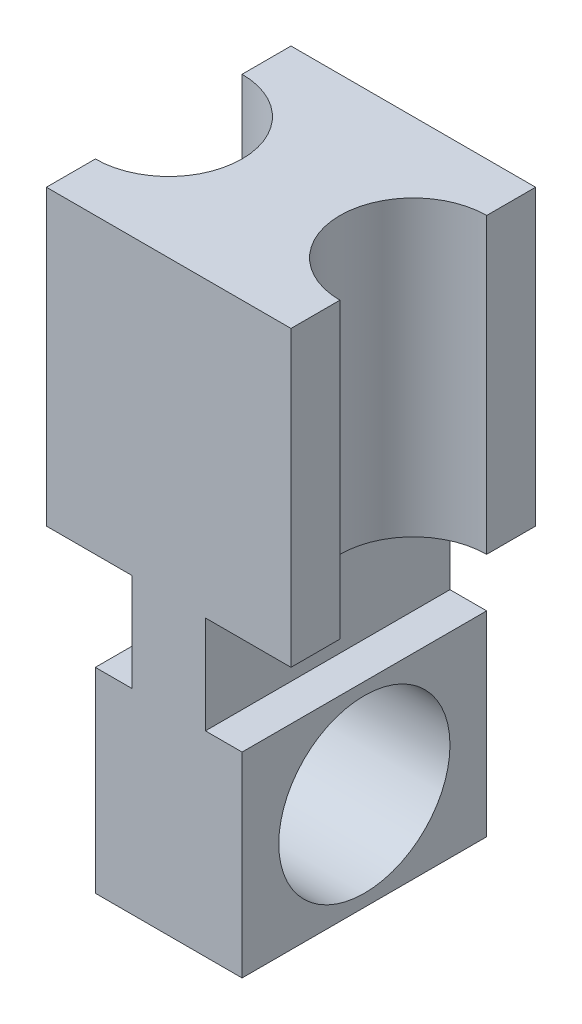
ISO-10303-21;
HEADER;
FILE_DESCRIPTION(('STEP AP214'),'2;1');
FILE_NAME('part.step','',(''),(''),'','','');
FILE_SCHEMA(('AUTOMOTIVE_DESIGN { 1 0 10303 214 1 1 1 1 }'));
ENDSEC;
DATA;
#1=APPLICATION_CONTEXT('core data for automotive mechanical design processes');
#2=APPLICATION_PROTOCOL_DEFINITION('international standard','automotive_design',2000,#1);
#3=PRODUCT_CONTEXT('',#1,'mechanical');
#4=PRODUCT('Part','Part','',(#3));
#5=PRODUCT_RELATED_PRODUCT_CATEGORY('part','',(#4));
#6=PRODUCT_DEFINITION_FORMATION('','',#4);
#7=PRODUCT_DEFINITION_CONTEXT('part definition',#1,'design');
#8=PRODUCT_DEFINITION('design','',#6,#7);
#9=PRODUCT_DEFINITION_SHAPE('','',#8);
#10=(LENGTH_UNIT() NAMED_UNIT(*) SI_UNIT(.MILLI.,.METRE.));
#11=(NAMED_UNIT(*) PLANE_ANGLE_UNIT() SI_UNIT($,.RADIAN.));
#12=(NAMED_UNIT(*) SI_UNIT($,.STERADIAN.) SOLID_ANGLE_UNIT());
#13=UNCERTAINTY_MEASURE_WITH_UNIT(LENGTH_MEASURE(1.E-05),#10,'distance_accuracy_value','');
#14=(GEOMETRIC_REPRESENTATION_CONTEXT(3) GLOBAL_UNCERTAINTY_ASSIGNED_CONTEXT((#13)) GLOBAL_UNIT_ASSIGNED_CONTEXT((#10,
#11,#12)) REPRESENTATION_CONTEXT('',''));
#15=CARTESIAN_POINT('',(0.,0.,0.));
#16=DIRECTION('',(0.,0.,1.));
#17=DIRECTION('',(1.,0.,0.));
#18=AXIS2_PLACEMENT_3D('',#15,#16,#17);
#19=CARTESIAN_POINT('',(0.,152.4,-127.));
#20=DIRECTION('',(0.,0.,-1.));
#21=DIRECTION('',(-1.,0.,0.));
#22=AXIS2_PLACEMENT_3D('',#19,#20,#21);
#23=PLANE('',#22);
#24=DIRECTION('',(1.,0.,0.));
#25=VECTOR('',#24,1.);
#26=CARTESIAN_POINT('',(1.58603289232165E-13,-50.8,-127.));
#27=LINE('',#26,#25);
#28=CARTESIAN_POINT('',(82.55,-50.8,-127.));
#29=VERTEX_POINT('',#28);
#30=CARTESIAN_POINT('',(101.6,-50.8,-127.));
#31=VERTEX_POINT('',#30);
#32=EDGE_CURVE('E299',#29,#31,#27,.T.);
#33=ORIENTED_EDGE('',*,*,#32,.T.);
#34=DIRECTION('',(0.,-1.,0.));
#35=VECTOR('',#34,1.);
#36=CARTESIAN_POINT('',(101.6,152.4,-127.));
#37=LINE('',#36,#35);
#38=CARTESIAN_POINT('',(101.6,-152.4,-127.));
#39=VERTEX_POINT('',#38);
#40=EDGE_CURVE('E219',#31,#39,#37,.T.);
#41=ORIENTED_EDGE('',*,*,#40,.T.);
#42=DIRECTION('',(-1.,0.,0.));
#43=VECTOR('',#42,1.);
#44=CARTESIAN_POINT('',(0.,-152.4,-127.));
#45=LINE('',#44,#43);
#46=CARTESIAN_POINT('',(25.4,-152.4,-127.));
#47=VERTEX_POINT('',#46);
#48=EDGE_CURVE('E294',#39,#47,#45,.T.);
#49=ORIENTED_EDGE('',*,*,#48,.T.);
#50=DIRECTION('',(0.,-1.,0.));
#51=VECTOR('',#50,1.);
#52=CARTESIAN_POINT('',(25.4,152.4,-127.));
#53=LINE('',#52,#51);
#54=CARTESIAN_POINT('',(25.4,-50.8,-127.));
#55=VERTEX_POINT('',#54);
#56=EDGE_CURVE('E232',#55,#47,#53,.T.);
#57=ORIENTED_EDGE('',*,*,#56,.F.);
#58=DIRECTION('',(1.,0.,0.));
#59=VECTOR('',#58,1.);
#60=CARTESIAN_POINT('',(0.,-50.8,-127.));
#61=LINE('',#60,#59);
#62=CARTESIAN_POINT('',(44.45,-50.8,-127.));
#63=VERTEX_POINT('',#62);
#64=EDGE_CURVE('E298',#55,#63,#61,.T.);
#65=ORIENTED_EDGE('',*,*,#64,.T.);
#66=DIRECTION('',(0.,1.,0.));
#67=VECTOR('',#66,1.);
#68=CARTESIAN_POINT('',(44.4500000000001,152.4,-127.));
#69=LINE('',#68,#67);
#70=CARTESIAN_POINT('',(44.45,0.,-127.));
#71=VERTEX_POINT('',#70);
#72=EDGE_CURVE('E311',#63,#71,#69,.T.);
#73=ORIENTED_EDGE('',*,*,#72,.T.);
#74=DIRECTION('',(-1.,0.,0.));
#75=VECTOR('',#74,1.);
#76=CARTESIAN_POINT('',(0.,0.,-127.));
#77=LINE('',#76,#75);
#78=CARTESIAN_POINT('',(0.,0.,-127.));
#79=VERTEX_POINT('',#78);
#80=EDGE_CURVE('E284',#71,#79,#77,.T.);
#81=ORIENTED_EDGE('',*,*,#80,.T.);
#82=DIRECTION('',(0.,-1.,0.));
#83=VECTOR('',#82,1.);
#84=CARTESIAN_POINT('',(0.,152.4,-127.));
#85=LINE('',#84,#83);
#86=CARTESIAN_POINT('',(0.,152.4,-127.));
#87=VERTEX_POINT('',#86);
#88=EDGE_CURVE('E214',#87,#79,#85,.T.);
#89=ORIENTED_EDGE('',*,*,#88,.F.);
#90=DIRECTION('',(1.,0.,0.));
#91=VECTOR('',#90,1.);
#92=CARTESIAN_POINT('',(0.,152.4,-127.));
#93=LINE('',#92,#91);
#94=CARTESIAN_POINT('',(127.,152.4,-127.));
#95=VERTEX_POINT('',#94);
#96=EDGE_CURVE('E223',#87,#95,#93,.T.);
#97=ORIENTED_EDGE('',*,*,#96,.T.);
#98=DIRECTION('',(0.,-1.,0.));
#99=VECTOR('',#98,1.);
#100=CARTESIAN_POINT('',(127.,152.4,-127.));
#101=LINE('',#100,#99);
#102=CARTESIAN_POINT('',(127.,0.,-127.));
#103=VERTEX_POINT('',#102);
#104=EDGE_CURVE('E209',#95,#103,#101,.T.);
#105=ORIENTED_EDGE('',*,*,#104,.T.);
#106=DIRECTION('',(-1.,0.,0.));
#107=VECTOR('',#106,1.);
#108=CARTESIAN_POINT('',(0.,0.,-127.));
#109=LINE('',#108,#107);
#110=CARTESIAN_POINT('',(82.55,0.,-127.));
#111=VERTEX_POINT('',#110);
#112=EDGE_CURVE('E213',#103,#111,#109,.T.);
#113=ORIENTED_EDGE('',*,*,#112,.T.);
#114=DIRECTION('',(0.,-1.,0.));
#115=VECTOR('',#114,1.);
#116=CARTESIAN_POINT('',(82.55,152.4,-127.));
#117=LINE('',#116,#115);
#118=EDGE_CURVE('E303',#111,#29,#117,.T.);
#119=ORIENTED_EDGE('',*,*,#118,.T.);
#120=EDGE_LOOP('',(#33,#41,#49,#57,#65,#73,#81,#89,#97,#105,#113,#119));
#121=FACE_BOUND('',#120,.T.);
#122=ADVANCED_FACE('F38',(#121),#23,.T.);
#123=CARTESIAN_POINT('',(0.,152.4,0.));
#124=DIRECTION('',(0.,0.,-1.));
#125=DIRECTION('',(-1.,0.,0.));
#126=AXIS2_PLACEMENT_3D('',#123,#124,#125);
#127=PLANE('',#126);
#128=DIRECTION('',(0.,-1.,0.));
#129=VECTOR('',#128,1.);
#130=CARTESIAN_POINT('',(101.6,152.4,0.));
#131=LINE('',#130,#129);
#132=CARTESIAN_POINT('',(101.6,-50.8,0.));
#133=VERTEX_POINT('',#132);
#134=CARTESIAN_POINT('',(101.6,-152.4,0.));
#135=VERTEX_POINT('',#134);
#136=EDGE_CURVE('E253',#133,#135,#131,.T.);
#137=ORIENTED_EDGE('',*,*,#136,.F.);
#138=DIRECTION('',(1.,0.,0.));
#139=VECTOR('',#138,1.);
#140=CARTESIAN_POINT('',(1.58603289232165E-13,-50.8,0.));
#141=LINE('',#140,#139);
#142=CARTESIAN_POINT('',(82.55,-50.8,0.));
#143=VERTEX_POINT('',#142);
#144=EDGE_CURVE('E193',#143,#133,#141,.T.);
#145=ORIENTED_EDGE('',*,*,#144,.F.);
#146=DIRECTION('',(0.,-1.,0.));
#147=VECTOR('',#146,1.);
#148=CARTESIAN_POINT('',(82.55,152.4,0.));
#149=LINE('',#148,#147);
#150=CARTESIAN_POINT('',(82.55,0.,0.));
#151=VERTEX_POINT('',#150);
#152=EDGE_CURVE('E48',#151,#143,#149,.T.);
#153=ORIENTED_EDGE('',*,*,#152,.F.);
#154=DIRECTION('',(-1.,0.,0.));
#155=VECTOR('',#154,1.);
#156=CARTESIAN_POINT('',(0.,0.,0.));
#157=LINE('',#156,#155);
#158=CARTESIAN_POINT('',(127.,0.,0.));
#159=VERTEX_POINT('',#158);
#160=EDGE_CURVE('E199',#159,#151,#157,.T.);
#161=ORIENTED_EDGE('',*,*,#160,.F.);
#162=DIRECTION('',(0.,-1.,0.));
#163=VECTOR('',#162,1.);
#164=CARTESIAN_POINT('',(127.,152.4,0.));
#165=LINE('',#164,#163);
#166=CARTESIAN_POINT('',(127.,152.4,0.));
#167=VERTEX_POINT('',#166);
#168=EDGE_CURVE('E205',#167,#159,#165,.T.);
#169=ORIENTED_EDGE('',*,*,#168,.F.);
#170=DIRECTION('',(1.,0.,0.));
#171=VECTOR('',#170,1.);
#172=CARTESIAN_POINT('',(0.,152.4,0.));
#173=LINE('',#172,#171);
#174=CARTESIAN_POINT('',(0.,152.4,0.));
#175=VERTEX_POINT('',#174);
#176=EDGE_CURVE('E273',#175,#167,#173,.T.);
#177=ORIENTED_EDGE('',*,*,#176,.F.);
#178=DIRECTION('',(0.,-1.,0.));
#179=VECTOR('',#178,1.);
#180=CARTESIAN_POINT('',(0.,152.4,0.));
#181=LINE('',#180,#179);
#182=CARTESIAN_POINT('',(0.,0.,0.));
#183=VERTEX_POINT('',#182);
#184=EDGE_CURVE('E220',#175,#183,#181,.T.);
#185=ORIENTED_EDGE('',*,*,#184,.T.);
#186=DIRECTION('',(-1.,0.,0.));
#187=VECTOR('',#186,1.);
#188=CARTESIAN_POINT('',(0.,0.,0.));
#189=LINE('',#188,#187);
#190=CARTESIAN_POINT('',(44.45,0.,0.));
#191=VERTEX_POINT('',#190);
#192=EDGE_CURVE('E174',#191,#183,#189,.T.);
#193=ORIENTED_EDGE('',*,*,#192,.F.);
#194=DIRECTION('',(0.,1.,0.));
#195=VECTOR('',#194,1.);
#196=CARTESIAN_POINT('',(44.4500000000001,152.4,0.));
#197=LINE('',#196,#195);
#198=CARTESIAN_POINT('',(44.45,-50.8,0.));
#199=VERTEX_POINT('',#198);
#200=EDGE_CURVE('E180',#199,#191,#197,.T.);
#201=ORIENTED_EDGE('',*,*,#200,.F.);
#202=DIRECTION('',(1.,0.,0.));
#203=VECTOR('',#202,1.);
#204=CARTESIAN_POINT('',(0.,-50.8,0.));
#205=LINE('',#204,#203);
#206=CARTESIAN_POINT('',(25.4,-50.8,0.));
#207=VERTEX_POINT('',#206);
#208=EDGE_CURVE('E189',#207,#199,#205,.T.);
#209=ORIENTED_EDGE('',*,*,#208,.F.);
#210=DIRECTION('',(0.,-1.,0.));
#211=VECTOR('',#210,1.);
#212=CARTESIAN_POINT('',(25.4,152.4,0.));
#213=LINE('',#212,#211);
#214=CARTESIAN_POINT('',(25.4,-152.4,0.));
#215=VERTEX_POINT('',#214);
#216=EDGE_CURVE('E64',#207,#215,#213,.T.);
#217=ORIENTED_EDGE('',*,*,#216,.T.);
#218=DIRECTION('',(1.,0.,0.));
#219=VECTOR('',#218,1.);
#220=CARTESIAN_POINT('',(0.,-152.4,0.));
#221=LINE('',#220,#219);
#222=EDGE_CURVE('E222',#215,#135,#221,.T.);
#223=ORIENTED_EDGE('',*,*,#222,.T.);
#224=EDGE_LOOP('',(#137,#145,#153,#161,#169,#177,#185,#193,#201,#209,#217,#223));
#225=FACE_BOUND('',#224,.T.);
#226=ADVANCED_FACE('F345',(#225),#127,.F.);
#227=CARTESIAN_POINT('',(0.,-152.4,0.));
#228=DIRECTION('',(0.,1.,0.));
#229=DIRECTION('',(0.,0.,1.));
#230=AXIS2_PLACEMENT_3D('',#227,#228,#229);
#231=PLANE('',#230);
#232=DIRECTION('',(0.,0.,-1.));
#233=VECTOR('',#232,1.);
#234=CARTESIAN_POINT('',(101.6,-152.4,13.7160000000001));
#235=LINE('',#234,#233);
#236=EDGE_CURVE('E235',#135,#39,#235,.T.);
#237=ORIENTED_EDGE('',*,*,#236,.F.);
#238=ORIENTED_EDGE('',*,*,#222,.F.);
#239=DIRECTION('',(0.,0.,-1.));
#240=VECTOR('',#239,1.);
#241=CARTESIAN_POINT('',(25.4,-152.4,13.7160000000001));
#242=LINE('',#241,#240);
#243=EDGE_CURVE('E245',#215,#47,#242,.T.);
#244=ORIENTED_EDGE('',*,*,#243,.T.);
#245=ORIENTED_EDGE('',*,*,#48,.F.);
#246=EDGE_LOOP('',(#237,#238,#244,#245));
#247=FACE_BOUND('',#246,.T.);
#248=ADVANCED_FACE('F387',(#247),#231,.F.);
#249=CARTESIAN_POINT('',(82.55,-50.8,22.86));
#250=DIRECTION('',(0.,1.,0.));
#251=DIRECTION('',(-1.,0.,0.));
#252=AXIS2_PLACEMENT_3D('',#249,#250,#251);
#253=PLANE('',#252);
#254=ORIENTED_EDGE('',*,*,#144,.T.);
#255=DIRECTION('',(0.,0.,-1.));
#256=VECTOR('',#255,1.);
#257=CARTESIAN_POINT('',(101.6,-50.8,13.7160000000001));
#258=LINE('',#257,#256);
#259=EDGE_CURVE('E227',#133,#31,#258,.T.);
#260=ORIENTED_EDGE('',*,*,#259,.T.);
#261=ORIENTED_EDGE('',*,*,#32,.F.);
#262=DIRECTION('',(0.,0.,-1.));
#263=VECTOR('',#262,1.);
#264=CARTESIAN_POINT('',(82.55,-50.8,22.86));
#265=LINE('',#264,#263);
#266=EDGE_CURVE('E11',#143,#29,#265,.T.);
#267=ORIENTED_EDGE('',*,*,#266,.F.);
#268=EDGE_LOOP('',(#254,#260,#261,#267));
#269=FACE_BOUND('',#268,.T.);
#270=ADVANCED_FACE('F349',(#269),#253,.T.);
#271=CARTESIAN_POINT('',(0.,152.4,0.));
#272=DIRECTION('',(-1.,0.,0.));
#273=DIRECTION('',(0.,0.,1.));
#274=AXIS2_PLACEMENT_3D('',#271,#272,#273);
#275=PLANE('',#274);
#276=DIRECTION('',(0.,1.,0.));
#277=VECTOR('',#276,1.);
#278=CARTESIAN_POINT('',(0.,0.,-101.6));
#279=LINE('',#278,#277);
#280=CARTESIAN_POINT('',(0.,152.4,-101.6));
#281=VERTEX_POINT('',#280);
#282=CARTESIAN_POINT('',(0.,0.,-101.6));
#283=VERTEX_POINT('',#282);
#284=EDGE_CURVE('E56',#281,#283,#279,.F.);
#285=ORIENTED_EDGE('',*,*,#284,.F.);
#286=DIRECTION('',(0.,0.,-1.));
#287=VECTOR('',#286,1.);
#288=CARTESIAN_POINT('',(0.,152.4,0.));
#289=LINE('',#288,#287);
#290=EDGE_CURVE('E218',#281,#87,#289,.T.);
#291=ORIENTED_EDGE('',*,*,#290,.T.);
#292=ORIENTED_EDGE('',*,*,#88,.T.);
#293=DIRECTION('',(0.,0.,-1.));
#294=VECTOR('',#293,1.);
#295=CARTESIAN_POINT('',(0.,0.,22.86));
#296=LINE('',#295,#294);
#297=EDGE_CURVE('E176',#283,#79,#296,.T.);
#298=ORIENTED_EDGE('',*,*,#297,.F.);
#299=EDGE_LOOP('',(#285,#291,#292,#298));
#300=FACE_BOUND('',#299,.T.);
#301=ADVANCED_FACE('F326',(#300),#275,.T.);
#302=DIRECTION('',(0.,1.,0.));
#303=VECTOR('',#302,1.);
#304=CARTESIAN_POINT('',(0.,0.,-25.4));
#305=LINE('',#304,#303);
#306=CARTESIAN_POINT('',(0.,0.,-25.4));
#307=VERTEX_POINT('',#306);
#308=CARTESIAN_POINT('',(0.,152.4,-25.4));
#309=VERTEX_POINT('',#308);
#310=EDGE_CURVE('E154',#307,#309,#305,.T.);
#311=ORIENTED_EDGE('',*,*,#310,.F.);
#312=EDGE_CURVE('E165',#183,#307,#296,.T.);
#313=ORIENTED_EDGE('',*,*,#312,.F.);
#314=ORIENTED_EDGE('',*,*,#184,.F.);
#315=EDGE_CURVE('E168',#175,#309,#289,.T.);
#316=ORIENTED_EDGE('',*,*,#315,.T.);
#317=EDGE_LOOP('',(#311,#313,#314,#316));
#318=FACE_BOUND('',#317,.T.);
#319=ADVANCED_FACE('F40',(#318),#275,.T.);
#320=CARTESIAN_POINT('',(127.,152.4,0.));
#321=DIRECTION('',(-1.,0.,0.));
#322=DIRECTION('',(0.,0.,1.));
#323=AXIS2_PLACEMENT_3D('',#320,#321,#322);
#324=PLANE('',#323);
#325=DIRECTION('',(0.,0.,-1.));
#326=VECTOR('',#325,1.);
#327=CARTESIAN_POINT('',(127.,0.,22.86));
#328=LINE('',#327,#326);
#329=CARTESIAN_POINT('',(127.,0.,-101.6));
#330=VERTEX_POINT('',#329);
#331=EDGE_CURVE('E200',#330,#103,#328,.T.);
#332=ORIENTED_EDGE('',*,*,#331,.T.);
#333=ORIENTED_EDGE('',*,*,#104,.F.);
#334=DIRECTION('',(0.,0.,-1.));
#335=VECTOR('',#334,1.);
#336=CARTESIAN_POINT('',(127.,152.4,0.));
#337=LINE('',#336,#335);
#338=CARTESIAN_POINT('',(127.,152.4,-101.6));
#339=VERTEX_POINT('',#338);
#340=EDGE_CURVE('E280',#339,#95,#337,.T.);
#341=ORIENTED_EDGE('',*,*,#340,.F.);
#342=DIRECTION('',(0.,-1.,0.));
#343=VECTOR('',#342,1.);
#344=CARTESIAN_POINT('',(127.,152.4,-101.6));
#345=LINE('',#344,#343);
#346=EDGE_CURVE('E285',#330,#339,#345,.F.);
#347=ORIENTED_EDGE('',*,*,#346,.F.);
#348=EDGE_LOOP('',(#332,#333,#341,#347));
#349=FACE_BOUND('',#348,.T.);
#350=ADVANCED_FACE('F358',(#349),#324,.F.);
#351=CARTESIAN_POINT('',(127.,0.,-25.4));
#352=VERTEX_POINT('',#351);
#353=EDGE_CURVE('E204',#159,#352,#328,.T.);
#354=ORIENTED_EDGE('',*,*,#353,.T.);
#355=DIRECTION('',(0.,-1.,0.));
#356=VECTOR('',#355,1.);
#357=CARTESIAN_POINT('',(127.,152.4,-25.4));
#358=LINE('',#357,#356);
#359=CARTESIAN_POINT('',(127.,152.4,-25.4));
#360=VERTEX_POINT('',#359);
#361=EDGE_CURVE('E270',#360,#352,#358,.T.);
#362=ORIENTED_EDGE('',*,*,#361,.F.);
#363=EDGE_CURVE('E276',#167,#360,#337,.T.);
#364=ORIENTED_EDGE('',*,*,#363,.F.);
#365=ORIENTED_EDGE('',*,*,#168,.T.);
#366=EDGE_LOOP('',(#354,#362,#364,#365));
#367=FACE_BOUND('',#366,.T.);
#368=ADVANCED_FACE('F370',(#367),#324,.F.);
#369=CARTESIAN_POINT('',(0.,152.4,0.));
#370=DIRECTION('',(0.,1.,0.));
#371=DIRECTION('',(0.,0.,1.));
#372=AXIS2_PLACEMENT_3D('',#369,#370,#371);
#373=PLANE('',#372);
#374=CARTESIAN_POINT('',(0.,152.4,-63.5));
#375=DIRECTION('',(0.,1.,0.));
#376=DIRECTION('',(0.,0.,1.));
#377=AXIS2_PLACEMENT_3D('',#374,#375,#376);
#378=CIRCLE('',#377,38.1);
#379=EDGE_CURVE('E160',#309,#281,#378,.T.);
#380=ORIENTED_EDGE('',*,*,#379,.F.);
#381=ORIENTED_EDGE('',*,*,#315,.F.);
#382=ORIENTED_EDGE('',*,*,#176,.T.);
#383=ORIENTED_EDGE('',*,*,#363,.T.);
#384=CARTESIAN_POINT('',(127.,152.4,-63.5));
#385=DIRECTION('',(0.,1.,0.));
#386=DIRECTION('',(0.,0.,1.));
#387=AXIS2_PLACEMENT_3D('',#384,#385,#386);
#388=CIRCLE('',#387,38.1);
#389=EDGE_CURVE('E288',#339,#360,#388,.T.);
#390=ORIENTED_EDGE('',*,*,#389,.F.);
#391=ORIENTED_EDGE('',*,*,#340,.T.);
#392=ORIENTED_EDGE('',*,*,#96,.F.);
#393=ORIENTED_EDGE('',*,*,#290,.F.);
#394=EDGE_LOOP('',(#380,#381,#382,#383,#390,#391,#392,#393));
#395=FACE_BOUND('',#394,.T.);
#396=ADVANCED_FACE('F364',(#395),#373,.T.);
#397=CARTESIAN_POINT('',(127.,152.4,-63.5));
#398=DIRECTION('',(0.,-1.,0.));
#399=DIRECTION('',(0.,0.,-1.));
#400=AXIS2_PLACEMENT_3D('',#397,#398,#399);
#401=CYLINDRICAL_SURFACE('',#400,38.1);
#402=ORIENTED_EDGE('',*,*,#346,.T.);
#403=ORIENTED_EDGE('',*,*,#389,.T.);
#404=ORIENTED_EDGE('',*,*,#361,.T.);
#405=CARTESIAN_POINT('',(127.,0.,-63.5));
#406=DIRECTION('',(0.,1.,0.));
#407=DIRECTION('',(0.,0.,1.));
#408=AXIS2_PLACEMENT_3D('',#405,#406,#407);
#409=CIRCLE('',#408,38.1);
#410=EDGE_CURVE('E181',#352,#330,#409,.F.);
#411=ORIENTED_EDGE('',*,*,#410,.T.);
#412=EDGE_LOOP('',(#402,#403,#404,#411));
#413=FACE_BOUND('',#412,.T.);
#414=ADVANCED_FACE('F362',(#413),#401,.F.);
#415=CARTESIAN_POINT('',(44.45,0.,22.86));
#416=DIRECTION('',(0.,-1.,0.));
#417=DIRECTION('',(1.,0.,0.));
#418=AXIS2_PLACEMENT_3D('',#415,#416,#417);
#419=PLANE('',#418);
#420=CARTESIAN_POINT('',(0.,0.,-63.5));
#421=DIRECTION('',(0.,1.,0.));
#422=DIRECTION('',(0.,0.,1.));
#423=AXIS2_PLACEMENT_3D('',#420,#421,#422);
#424=CIRCLE('',#423,38.1);
#425=EDGE_CURVE('E151',#307,#283,#424,.T.);
#426=ORIENTED_EDGE('',*,*,#425,.T.);
#427=ORIENTED_EDGE('',*,*,#297,.T.);
#428=ORIENTED_EDGE('',*,*,#80,.F.);
#429=DIRECTION('',(0.,0.,-1.));
#430=VECTOR('',#429,1.);
#431=CARTESIAN_POINT('',(44.45,0.,22.86));
#432=LINE('',#431,#430);
#433=EDGE_CURVE('E185',#191,#71,#432,.T.);
#434=ORIENTED_EDGE('',*,*,#433,.F.);
#435=ORIENTED_EDGE('',*,*,#192,.T.);
#436=ORIENTED_EDGE('',*,*,#312,.T.);
#437=EDGE_LOOP('',(#426,#427,#428,#434,#435,#436));
#438=FACE_BOUND('',#437,.T.);
#439=ADVANCED_FACE('F171',(#438),#419,.T.);
#440=CARTESIAN_POINT('',(44.45,0.,22.86));
#441=DIRECTION('',(-1.,0.,0.));
#442=DIRECTION('',(0.,-1.,0.));
#443=AXIS2_PLACEMENT_3D('',#440,#441,#442);
#444=PLANE('',#443);
#445=DIRECTION('',(0.,0.,-1.));
#446=VECTOR('',#445,1.);
#447=CARTESIAN_POINT('',(44.45,-50.8,22.86));
#448=LINE('',#447,#446);
#449=EDGE_CURVE('E190',#199,#63,#448,.T.);
#450=ORIENTED_EDGE('',*,*,#449,.F.);
#451=ORIENTED_EDGE('',*,*,#200,.T.);
#452=ORIENTED_EDGE('',*,*,#433,.T.);
#453=ORIENTED_EDGE('',*,*,#72,.F.);
#454=EDGE_LOOP('',(#450,#451,#452,#453));
#455=FACE_BOUND('',#454,.T.);
#456=ADVANCED_FACE('F380',(#455),#444,.T.);
#457=CARTESIAN_POINT('',(44.45,-50.8,22.86));
#458=DIRECTION('',(0.,1.,0.));
#459=DIRECTION('',(0.,0.,1.));
#460=AXIS2_PLACEMENT_3D('',#457,#458,#459);
#461=PLANE('',#460);
#462=DIRECTION('',(0.,0.,-1.));
#463=VECTOR('',#462,1.);
#464=CARTESIAN_POINT('',(25.4,-50.8,13.7160000000001));
#465=LINE('',#464,#463);
#466=EDGE_CURVE('E241',#207,#55,#465,.T.);
#467=ORIENTED_EDGE('',*,*,#466,.F.);
#468=ORIENTED_EDGE('',*,*,#208,.T.);
#469=ORIENTED_EDGE('',*,*,#449,.T.);
#470=ORIENTED_EDGE('',*,*,#64,.F.);
#471=EDGE_LOOP('',(#467,#468,#469,#470));
#472=FACE_BOUND('',#471,.T.);
#473=ADVANCED_FACE('F383',(#472),#461,.T.);
#474=CARTESIAN_POINT('',(127.,0.,22.86));
#475=DIRECTION('',(0.,-1.,0.));
#476=DIRECTION('',(1.,0.,0.));
#477=AXIS2_PLACEMENT_3D('',#474,#475,#476);
#478=PLANE('',#477);
#479=ORIENTED_EDGE('',*,*,#331,.F.);
#480=ORIENTED_EDGE('',*,*,#410,.F.);
#481=ORIENTED_EDGE('',*,*,#353,.F.);
#482=ORIENTED_EDGE('',*,*,#160,.T.);
#483=DIRECTION('',(0.,0.,-1.));
#484=VECTOR('',#483,1.);
#485=CARTESIAN_POINT('',(82.55,0.,22.86));
#486=LINE('',#485,#484);
#487=EDGE_CURVE('E195',#151,#111,#486,.T.);
#488=ORIENTED_EDGE('',*,*,#487,.T.);
#489=ORIENTED_EDGE('',*,*,#112,.F.);
#490=EDGE_LOOP('',(#479,#480,#481,#482,#488,#489));
#491=FACE_BOUND('',#490,.T.);
#492=ADVANCED_FACE('F355',(#491),#478,.T.);
#493=CARTESIAN_POINT('',(82.55,0.,22.86));
#494=DIRECTION('',(1.,0.,0.));
#495=DIRECTION('',(0.,0.,-1.));
#496=AXIS2_PLACEMENT_3D('',#493,#494,#495);
#497=PLANE('',#496);
#498=ORIENTED_EDGE('',*,*,#487,.F.);
#499=ORIENTED_EDGE('',*,*,#152,.T.);
#500=ORIENTED_EDGE('',*,*,#266,.T.);
#501=ORIENTED_EDGE('',*,*,#118,.F.);
#502=EDGE_LOOP('',(#498,#499,#500,#501));
#503=FACE_BOUND('',#502,.T.);
#504=ADVANCED_FACE('F352',(#503),#497,.T.);
#505=CARTESIAN_POINT('',(25.4,-50.8,13.7160000000001));
#506=DIRECTION('',(1.,0.,0.));
#507=DIRECTION('',(0.,1.,0.));
#508=AXIS2_PLACEMENT_3D('',#505,#506,#507);
#509=PLANE('',#508);
#510=ORIENTED_EDGE('',*,*,#56,.T.);
#511=ORIENTED_EDGE('',*,*,#243,.F.);
#512=ORIENTED_EDGE('',*,*,#216,.F.);
#513=ORIENTED_EDGE('',*,*,#466,.T.);
#514=EDGE_LOOP('',(#510,#511,#512,#513));
#515=FACE_BOUND('',#514,.T.);
#516=CARTESIAN_POINT('',(25.4,-101.6,-63.5));
#517=DIRECTION('',(1.,0.,0.));
#518=DIRECTION('',(0.,1.,0.));
#519=AXIS2_PLACEMENT_3D('',#516,#517,#518);
#520=CIRCLE('',#519,44.45);
#521=CARTESIAN_POINT('',(25.4,-57.15,-63.5));
#522=VERTEX_POINT('',#521);
#523=EDGE_CURVE('E224',#522,#522,#520,.T.);
#524=ORIENTED_EDGE('',*,*,#523,.T.);
#525=EDGE_LOOP('',(#524));
#526=FACE_BOUND('',#525,.T.);
#527=ADVANCED_FACE('F339',(#515,#526),#509,.F.);
#528=CARTESIAN_POINT('',(101.6,-50.8,13.7160000000001));
#529=DIRECTION('',(1.,0.,0.));
#530=DIRECTION('',(0.,1.,0.));
#531=AXIS2_PLACEMENT_3D('',#528,#529,#530);
#532=PLANE('',#531);
#533=CARTESIAN_POINT('',(101.6,-101.6,-63.5));
#534=DIRECTION('',(1.,0.,0.));
#535=DIRECTION('',(0.,1.,0.));
#536=AXIS2_PLACEMENT_3D('',#533,#534,#535);
#537=CIRCLE('',#536,44.45);
#538=CARTESIAN_POINT('',(101.6,-57.15,-63.5));
#539=VERTEX_POINT('',#538);
#540=EDGE_CURVE('E42',#539,#539,#537,.T.);
#541=ORIENTED_EDGE('',*,*,#540,.F.);
#542=EDGE_LOOP('',(#541));
#543=FACE_BOUND('',#542,.T.);
#544=ORIENTED_EDGE('',*,*,#259,.F.);
#545=ORIENTED_EDGE('',*,*,#136,.T.);
#546=ORIENTED_EDGE('',*,*,#236,.T.);
#547=ORIENTED_EDGE('',*,*,#40,.F.);
#548=EDGE_LOOP('',(#544,#545,#546,#547));
#549=FACE_BOUND('',#548,.T.);
#550=ADVANCED_FACE('F336',(#543,#549),#532,.T.);
#551=CARTESIAN_POINT('',(249.428,-101.6,-63.5));
#552=DIRECTION('',(-1.,0.,0.));
#553=DIRECTION('',(0.,0.,1.));
#554=AXIS2_PLACEMENT_3D('',#551,#552,#553);
#555=CYLINDRICAL_SURFACE('',#554,44.45);
#556=ORIENTED_EDGE('',*,*,#523,.F.);
#557=EDGE_LOOP('',(#556));
#558=FACE_BOUND('',#557,.T.);
#559=ORIENTED_EDGE('',*,*,#540,.T.);
#560=EDGE_LOOP('',(#559));
#561=FACE_BOUND('',#560,.T.);
#562=ADVANCED_FACE('F334',(#558,#561),#555,.F.);
#563=CARTESIAN_POINT('',(0.,0.,-63.5));
#564=DIRECTION('',(0.,1.,0.));
#565=DIRECTION('',(0.,0.,1.));
#566=AXIS2_PLACEMENT_3D('',#563,#564,#565);
#567=CYLINDRICAL_SURFACE('',#566,38.1);
#568=ORIENTED_EDGE('',*,*,#284,.T.);
#569=ORIENTED_EDGE('',*,*,#425,.F.);
#570=ORIENTED_EDGE('',*,*,#310,.T.);
#571=ORIENTED_EDGE('',*,*,#379,.T.);
#572=EDGE_LOOP('',(#568,#569,#570,#571));
#573=FACE_BOUND('',#572,.T.);
#574=ADVANCED_FACE('F153',(#573),#567,.F.);
#575=CLOSED_SHELL('',(#122,#226,#248,#270,#301,#319,#350,#368,#396,#414,#439,#456,#473,#492,
#504,#527,#550,#562,#574));
#576=MANIFOLD_SOLID_BREP('B2',#575);
#577=ADVANCED_BREP_SHAPE_REPRESENTATION('',(#18,#576),#14);
#578=SHAPE_DEFINITION_REPRESENTATION(#9,#577);
ENDSEC;
END-ISO-10303-21;
